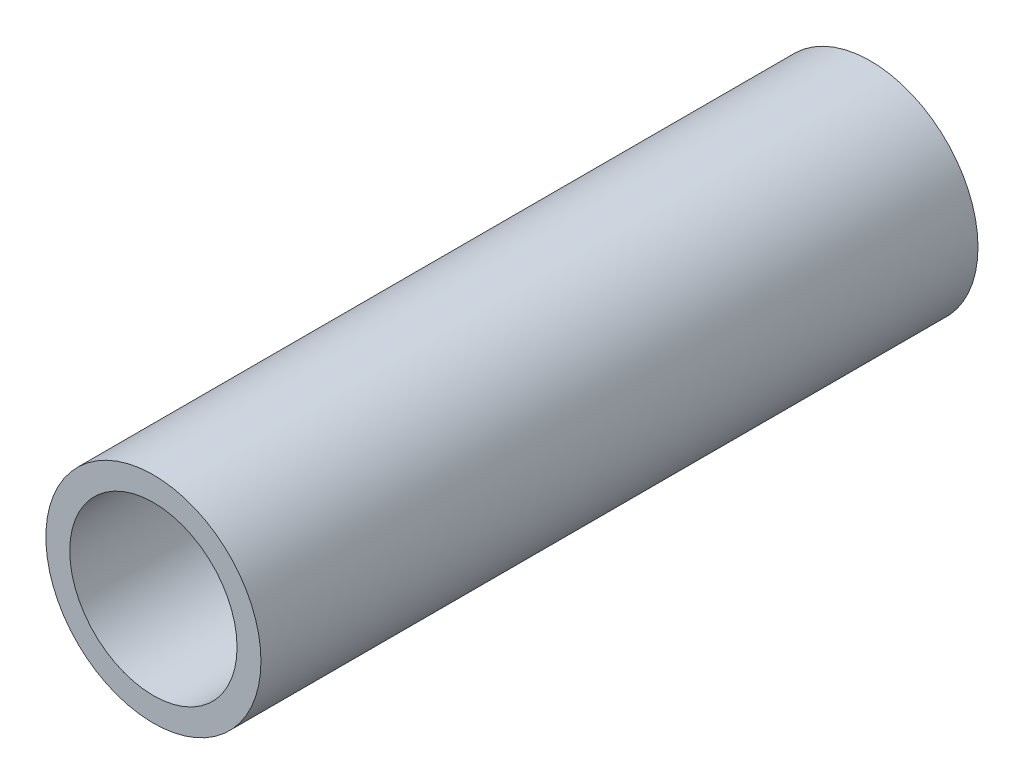
ISO-10303-21;
HEADER;
FILE_DESCRIPTION(('STEP AP214'),'2;1');
FILE_NAME('part.step','',(''),(''),'','','');
FILE_SCHEMA(('AUTOMOTIVE_DESIGN { 1 0 10303 214 1 1 1 1 }'));
ENDSEC;
DATA;
#1=APPLICATION_CONTEXT('core data for automotive mechanical design processes');
#2=APPLICATION_PROTOCOL_DEFINITION('international standard','automotive_design',2000,#1);
#3=PRODUCT_CONTEXT('',#1,'mechanical');
#4=PRODUCT('Part','Part','',(#3));
#5=PRODUCT_RELATED_PRODUCT_CATEGORY('part','',(#4));
#6=PRODUCT_DEFINITION_FORMATION('','',#4);
#7=PRODUCT_DEFINITION_CONTEXT('part definition',#1,'design');
#8=PRODUCT_DEFINITION('design','',#6,#7);
#9=PRODUCT_DEFINITION_SHAPE('','',#8);
#10=(LENGTH_UNIT() NAMED_UNIT(*) SI_UNIT(.MILLI.,.METRE.));
#11=(NAMED_UNIT(*) PLANE_ANGLE_UNIT() SI_UNIT($,.RADIAN.));
#12=(NAMED_UNIT(*) SI_UNIT($,.STERADIAN.) SOLID_ANGLE_UNIT());
#13=UNCERTAINTY_MEASURE_WITH_UNIT(LENGTH_MEASURE(1.E-05),#10,'distance_accuracy_value','');
#14=(GEOMETRIC_REPRESENTATION_CONTEXT(3) GLOBAL_UNCERTAINTY_ASSIGNED_CONTEXT((#13)) GLOBAL_UNIT_ASSIGNED_CONTEXT((#10,
#11,#12)) REPRESENTATION_CONTEXT('',''));
#15=CARTESIAN_POINT('',(0.,0.,0.));
#16=DIRECTION('',(0.,0.,1.));
#17=DIRECTION('',(1.,0.,0.));
#18=AXIS2_PLACEMENT_3D('',#15,#16,#17);
#19=CARTESIAN_POINT('',(0.,0.,15.));
#20=DIRECTION('',(0.,0.,1.));
#21=DIRECTION('',(1.,0.,0.));
#22=AXIS2_PLACEMENT_3D('',#19,#20,#21);
#23=PLANE('',#22);
#24=CARTESIAN_POINT('',(0.,0.,15.));
#25=DIRECTION('',(0.,0.,1.));
#26=DIRECTION('',(1.,0.,0.));
#27=AXIS2_PLACEMENT_3D('',#24,#25,#26);
#28=CIRCLE('',#27,2.25);
#29=CARTESIAN_POINT('',(2.25,0.,15.));
#30=VERTEX_POINT('',#29);
#31=EDGE_CURVE('E10',#30,#30,#28,.T.);
#32=ORIENTED_EDGE('',*,*,#31,.T.);
#33=EDGE_LOOP('',(#32));
#34=FACE_BOUND('',#33,.T.);
#35=CARTESIAN_POINT('',(0.,0.,15.));
#36=DIRECTION('',(0.,0.,1.));
#37=DIRECTION('',(1.,0.,0.));
#38=AXIS2_PLACEMENT_3D('',#35,#36,#37);
#39=CIRCLE('',#38,1.75);
#40=CARTESIAN_POINT('',(1.75,0.,15.));
#41=VERTEX_POINT('',#40);
#42=EDGE_CURVE('E43',#41,#41,#39,.T.);
#43=ORIENTED_EDGE('',*,*,#42,.F.);
#44=EDGE_LOOP('',(#43));
#45=FACE_BOUND('',#44,.T.);
#46=ADVANCED_FACE('F32',(#34,#45),#23,.T.);
#47=CARTESIAN_POINT('',(0.,0.,0.));
#48=DIRECTION('',(0.,0.,1.));
#49=DIRECTION('',(1.,0.,0.));
#50=AXIS2_PLACEMENT_3D('',#47,#48,#49);
#51=PLANE('',#50);
#52=CARTESIAN_POINT('',(0.,0.,0.));
#53=DIRECTION('',(0.,0.,1.));
#54=DIRECTION('',(1.,0.,0.));
#55=AXIS2_PLACEMENT_3D('',#52,#53,#54);
#56=CIRCLE('',#55,2.25);
#57=CARTESIAN_POINT('',(2.25,0.,0.));
#58=VERTEX_POINT('',#57);
#59=EDGE_CURVE('E36',#58,#58,#56,.T.);
#60=ORIENTED_EDGE('',*,*,#59,.F.);
#61=EDGE_LOOP('',(#60));
#62=FACE_BOUND('',#61,.T.);
#63=CARTESIAN_POINT('',(0.,0.,0.));
#64=DIRECTION('',(0.,0.,1.));
#65=DIRECTION('',(1.,0.,0.));
#66=AXIS2_PLACEMENT_3D('',#63,#64,#65);
#67=CIRCLE('',#66,1.75);
#68=CARTESIAN_POINT('',(1.75,0.,0.));
#69=VERTEX_POINT('',#68);
#70=EDGE_CURVE('E45',#69,#69,#67,.T.);
#71=ORIENTED_EDGE('',*,*,#70,.T.);
#72=EDGE_LOOP('',(#71));
#73=FACE_BOUND('',#72,.T.);
#74=ADVANCED_FACE('F55',(#62,#73),#51,.F.);
#75=CARTESIAN_POINT('',(0.,0.,15.));
#76=DIRECTION('',(0.,0.,-1.));
#77=DIRECTION('',(-1.,0.,0.));
#78=AXIS2_PLACEMENT_3D('',#75,#76,#77);
#79=CYLINDRICAL_SURFACE('',#78,2.25);
#80=ORIENTED_EDGE('',*,*,#31,.F.);
#81=EDGE_LOOP('',(#80));
#82=FACE_BOUND('',#81,.T.);
#83=ORIENTED_EDGE('',*,*,#59,.T.);
#84=EDGE_LOOP('',(#83));
#85=FACE_BOUND('',#84,.T.);
#86=ADVANCED_FACE('F34',(#82,#85),#79,.T.);
#87=CARTESIAN_POINT('',(0.,0.,15.));
#88=DIRECTION('',(0.,0.,-1.));
#89=DIRECTION('',(-1.,0.,0.));
#90=AXIS2_PLACEMENT_3D('',#87,#88,#89);
#91=CYLINDRICAL_SURFACE('',#90,1.75);
#92=ORIENTED_EDGE('',*,*,#42,.T.);
#93=EDGE_LOOP('',(#92));
#94=FACE_BOUND('',#93,.T.);
#95=ORIENTED_EDGE('',*,*,#70,.F.);
#96=EDGE_LOOP('',(#95));
#97=FACE_BOUND('',#96,.T.);
#98=ADVANCED_FACE('F51',(#94,#97),#91,.F.);
#99=CLOSED_SHELL('',(#46,#74,#86,#98));
#100=MANIFOLD_SOLID_BREP('B2',#99);
#101=ADVANCED_BREP_SHAPE_REPRESENTATION('',(#18,#100),#14);
#102=SHAPE_DEFINITION_REPRESENTATION(#9,#101);
ENDSEC;
END-ISO-10303-21;
